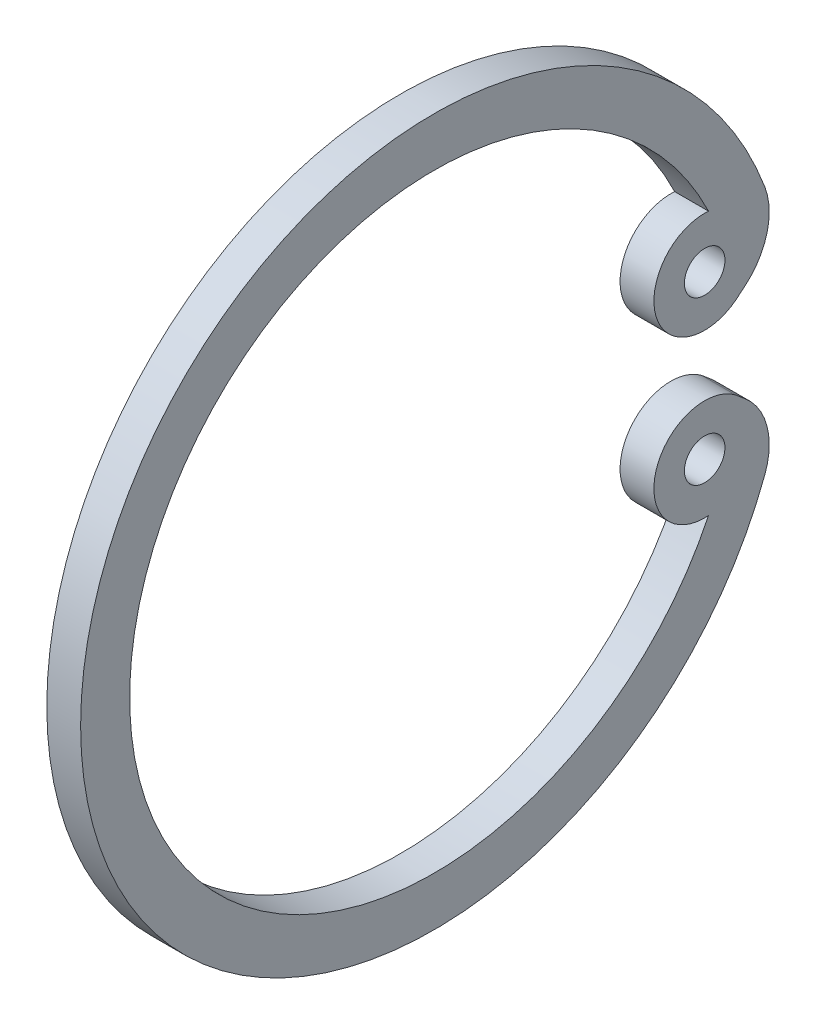
ISO-10303-21;
HEADER;
FILE_DESCRIPTION(('STEP AP214'),'2;1');
FILE_NAME('part.step','',(''),(''),'','','');
FILE_SCHEMA(('AUTOMOTIVE_DESIGN { 1 0 10303 214 1 1 1 1 }'));
ENDSEC;
DATA;
#1=APPLICATION_CONTEXT('core data for automotive mechanical design processes');
#2=APPLICATION_PROTOCOL_DEFINITION('international standard','automotive_design',2000,#1);
#3=PRODUCT_CONTEXT('',#1,'mechanical');
#4=PRODUCT('Part','Part','',(#3));
#5=PRODUCT_RELATED_PRODUCT_CATEGORY('part','',(#4));
#6=PRODUCT_DEFINITION_FORMATION('','',#4);
#7=PRODUCT_DEFINITION_CONTEXT('part definition',#1,'design');
#8=PRODUCT_DEFINITION('design','',#6,#7);
#9=PRODUCT_DEFINITION_SHAPE('','',#8);
#10=(LENGTH_UNIT() NAMED_UNIT(*) SI_UNIT(.MILLI.,.METRE.));
#11=(NAMED_UNIT(*) PLANE_ANGLE_UNIT() SI_UNIT($,.RADIAN.));
#12=(NAMED_UNIT(*) SI_UNIT($,.STERADIAN.) SOLID_ANGLE_UNIT());
#13=UNCERTAINTY_MEASURE_WITH_UNIT(LENGTH_MEASURE(1.E-05),#10,'distance_accuracy_value','');
#14=(GEOMETRIC_REPRESENTATION_CONTEXT(3) GLOBAL_UNCERTAINTY_ASSIGNED_CONTEXT((#13)) GLOBAL_UNIT_ASSIGNED_CONTEXT((#10,
#11,#12)) REPRESENTATION_CONTEXT('',''));
#15=CARTESIAN_POINT('',(0.,0.,0.));
#16=DIRECTION('',(0.,0.,1.));
#17=DIRECTION('',(1.,0.,0.));
#18=AXIS2_PLACEMENT_3D('',#15,#16,#17);
#19=CARTESIAN_POINT('',(18.3611111111111,-0.00016281321046866,9.93971753018335));
#20=DIRECTION('',(1.,0.,0.));
#21=DIRECTION('',(0.,0.,-1.));
#22=AXIS2_PLACEMENT_3D('',#19,#20,#21);
#23=CYLINDRICAL_SURFACE('',#22,2.5000000372529);
#24=CARTESIAN_POINT('',(18.6388888888889,-0.00016281321046866,9.93971753018335));
#25=DIRECTION('',(-1.,0.,0.));
#26=DIRECTION('',(0.,0.,1.));
#27=AXIS2_PLACEMENT_3D('',#24,#25,#26);
#28=CIRCLE('',#27,2.5000000372529);
#29=CARTESIAN_POINT('',(18.6388888888889,-1.08255334468496,7.68618010567962));
#30=VERTEX_POINT('',#29);
#31=CARTESIAN_POINT('',(18.6388888888889,1.08222771826402,7.68618010567963));
#32=VERTEX_POINT('',#31);
#33=EDGE_CURVE('E133',#30,#32,#28,.T.);
#34=ORIENTED_EDGE('',*,*,#33,.F.);
#35=DIRECTION('',(1.,0.,0.));
#36=VECTOR('',#35,1.);
#37=CARTESIAN_POINT('',(18.3611111111111,-1.08255334468496,7.68618010567962));
#38=LINE('',#37,#36);
#39=CARTESIAN_POINT('',(18.3611111111111,-1.08255334468496,7.68618010567962));
#40=VERTEX_POINT('',#39);
#41=EDGE_CURVE('E11',#40,#30,#38,.T.);
#42=ORIENTED_EDGE('',*,*,#41,.F.);
#43=CARTESIAN_POINT('',(18.3611111111111,-0.00016281321046866,9.93971753018335));
#44=DIRECTION('',(-1.,0.,0.));
#45=DIRECTION('',(0.,0.,1.));
#46=AXIS2_PLACEMENT_3D('',#43,#44,#45);
#47=CIRCLE('',#46,2.5000000372529);
#48=CARTESIAN_POINT('',(18.3611111111111,1.08222771826402,7.68618010567963));
#49=VERTEX_POINT('',#48);
#50=EDGE_CURVE('E154',#40,#49,#47,.T.);
#51=ORIENTED_EDGE('',*,*,#50,.T.);
#52=DIRECTION('',(1.,0.,0.));
#53=VECTOR('',#52,1.);
#54=CARTESIAN_POINT('',(18.3611111111111,1.08222771826402,7.68618010567963));
#55=LINE('',#54,#53);
#56=EDGE_CURVE('E39',#49,#32,#55,.T.);
#57=ORIENTED_EDGE('',*,*,#56,.T.);
#58=EDGE_LOOP('',(#34,#42,#51,#57));
#59=FACE_BOUND('',#58,.T.);
#60=ADVANCED_FACE('F36',(#59),#23,.F.);
#61=CARTESIAN_POINT('',(18.3611111111111,-0.666917459563021,7.71771885059295));
#62=DIRECTION('',(1.,0.,0.));
#63=DIRECTION('',(0.,0.,-1.));
#64=AXIS2_PLACEMENT_3D('',#61,#62,#63);
#65=CYLINDRICAL_SURFACE('',#64,0.416830758740048);
#66=CARTESIAN_POINT('',(18.6388888888889,-0.666917459563021,7.71771885059295));
#67=DIRECTION('',(1.,0.,0.));
#68=DIRECTION('',(0.,0.,-1.));
#69=AXIS2_PLACEMENT_3D('',#66,#67,#68);
#70=CIRCLE('',#69,0.416830758740048);
#71=CARTESIAN_POINT('',(18.6388888888889,-0.337229909778591,7.46266199232613));
#72=VERTEX_POINT('',#71);
#73=EDGE_CURVE('E152',#72,#30,#70,.T.);
#74=ORIENTED_EDGE('',*,*,#73,.F.);
#75=DIRECTION('',(1.,0.,0.));
#76=VECTOR('',#75,1.);
#77=CARTESIAN_POINT('',(18.3611111111111,-0.337229909778591,7.46266199232613));
#78=LINE('',#77,#76);
#79=CARTESIAN_POINT('',(18.3611111111111,-0.337229909778591,7.46266199232613));
#80=VERTEX_POINT('',#79);
#81=EDGE_CURVE('E45',#80,#72,#78,.T.);
#82=ORIENTED_EDGE('',*,*,#81,.F.);
#83=CARTESIAN_POINT('',(18.3611111111111,-0.666917459563021,7.71771885059295));
#84=DIRECTION('',(1.,0.,0.));
#85=DIRECTION('',(0.,0.,-1.));
#86=AXIS2_PLACEMENT_3D('',#83,#84,#85);
#87=CIRCLE('',#86,0.416830758740048);
#88=EDGE_CURVE('E123',#80,#40,#87,.T.);
#89=ORIENTED_EDGE('',*,*,#88,.T.);
#90=ORIENTED_EDGE('',*,*,#41,.T.);
#91=EDGE_LOOP('',(#74,#82,#89,#90));
#92=FACE_BOUND('',#91,.T.);
#93=ADVANCED_FACE('F166',(#92),#65,.T.);
#94=CARTESIAN_POINT('',(18.3611111111111,-0.401543008719923,7.38601662561193));
#95=DIRECTION('',(0.,0.766044443118982,-0.642787609686534));
#96=DIRECTION('',(0.,0.642787609686534,0.766044443118982));
#97=AXIS2_PLACEMENT_3D('',#94,#95,#96);
#98=PLANE('',#97);
#99=DIRECTION('',(0.,0.642787609686534,0.766044443118982));
#100=VECTOR('',#99,1.);
#101=CARTESIAN_POINT('',(18.6388888888889,-0.401543008719923,7.38601662561193));
#102=LINE('',#101,#100);
#103=CARTESIAN_POINT('',(18.6388888888889,-0.401543008719923,7.38601662561193));
#104=VERTEX_POINT('',#103);
#105=EDGE_CURVE('E110',#104,#72,#102,.T.);
#106=ORIENTED_EDGE('',*,*,#105,.F.);
#107=DIRECTION('',(1.,0.,0.));
#108=VECTOR('',#107,1.);
#109=CARTESIAN_POINT('',(18.3611111111111,-0.401543008719923,7.38601662561193));
#110=LINE('',#109,#108);
#111=CARTESIAN_POINT('',(18.3611111111111,-0.401543008719923,7.38601662561193));
#112=VERTEX_POINT('',#111);
#113=EDGE_CURVE('E105',#112,#104,#110,.T.);
#114=ORIENTED_EDGE('',*,*,#113,.F.);
#115=DIRECTION('',(0.,0.642787609686534,0.766044443118982));
#116=VECTOR('',#115,1.);
#117=CARTESIAN_POINT('',(18.3611111111111,-0.401543008719923,7.38601662561193));
#118=LINE('',#117,#116);
#119=EDGE_CURVE('E108',#112,#80,#118,.T.);
#120=ORIENTED_EDGE('',*,*,#119,.T.);
#121=ORIENTED_EDGE('',*,*,#81,.T.);
#122=EDGE_LOOP('',(#106,#114,#120,#121));
#123=FACE_BOUND('',#122,.T.);
#124=ADVANCED_FACE('F107',(#123),#98,.T.);
#125=CARTESIAN_POINT('',(18.3611111111111,-0.827123254897134,7.74312085321556));
#126=DIRECTION('',(1.,0.,0.));
#127=DIRECTION('',(0.,0.,-1.));
#128=AXIS2_PLACEMENT_3D('',#125,#126,#127);
#129=CYLINDRICAL_SURFACE('',#128,0.555555555555558);
#130=CARTESIAN_POINT('',(18.6388888888889,-0.827123254897134,7.74312085321556));
#131=DIRECTION('',(1.,0.,0.));
#132=DIRECTION('',(0.,0.,-1.));
#133=AXIS2_PLACEMENT_3D('',#130,#131,#132);
#134=CIRCLE('',#133,0.555555555555558);
#135=CARTESIAN_POINT('',(18.6388888888889,-1.02286333631576,7.22319028493276));
#136=VERTEX_POINT('',#135);
#137=EDGE_CURVE('E149',#136,#104,#134,.T.);
#138=ORIENTED_EDGE('',*,*,#137,.F.);
#139=DIRECTION('',(1.,0.,0.));
#140=VECTOR('',#139,1.);
#141=CARTESIAN_POINT('',(18.3611111111111,-1.02286333631576,7.22319028493276));
#142=LINE('',#141,#140);
#143=CARTESIAN_POINT('',(18.3611111111111,-1.02286333631576,7.22319028493276));
#144=VERTEX_POINT('',#143);
#145=EDGE_CURVE('E115',#144,#136,#142,.T.);
#146=ORIENTED_EDGE('',*,*,#145,.F.);
#147=CARTESIAN_POINT('',(18.3611111111111,-0.827123254897134,7.74312085321556));
#148=DIRECTION('',(1.,0.,0.));
#149=DIRECTION('',(0.,0.,-1.));
#150=AXIS2_PLACEMENT_3D('',#147,#148,#149);
#151=CIRCLE('',#150,0.555555555555558);
#152=EDGE_CURVE('E121',#144,#112,#151,.T.);
#153=ORIENTED_EDGE('',*,*,#152,.T.);
#154=ORIENTED_EDGE('',*,*,#113,.T.);
#155=EDGE_LOOP('',(#138,#146,#153,#154));
#156=FACE_BOUND('',#155,.T.);
#157=ADVANCED_FACE('F125',(#156),#129,.T.);
#158=CARTESIAN_POINT('',(18.3611111111111,-0.00016281321046866,9.93971753018335));
#159=DIRECTION('',(1.,0.,0.));
#160=DIRECTION('',(0.,0.,-1.));
#161=AXIS2_PLACEMENT_3D('',#158,#159,#160);
#162=CYLINDRICAL_SURFACE('',#161,2.90266026846901);
#163=CARTESIAN_POINT('',(18.6388888888889,-0.00016281321046866,9.93971753018335));
#164=DIRECTION('',(1.,0.,0.));
#165=DIRECTION('',(0.,0.,-1.));
#166=AXIS2_PLACEMENT_3D('',#163,#164,#165);
#167=CIRCLE('',#166,2.90266026846901);
#168=CARTESIAN_POINT('',(18.6388888888889,1.0225283518045,7.22318676187813));
#169=VERTEX_POINT('',#168);
#170=EDGE_CURVE('E146',#169,#136,#167,.T.);
#171=ORIENTED_EDGE('',*,*,#170,.F.);
#172=DIRECTION('',(1.,0.,0.));
#173=VECTOR('',#172,1.);
#174=CARTESIAN_POINT('',(18.3611111111111,1.0225283518045,7.22318676187813));
#175=LINE('',#174,#173);
#176=CARTESIAN_POINT('',(18.3611111111111,1.0225283518045,7.22318676187813));
#177=VERTEX_POINT('',#176);
#178=EDGE_CURVE('E158',#177,#169,#175,.T.);
#179=ORIENTED_EDGE('',*,*,#178,.F.);
#180=CARTESIAN_POINT('',(18.3611111111111,-0.00016281321046866,9.93971753018335));
#181=DIRECTION('',(1.,0.,0.));
#182=DIRECTION('',(0.,0.,-1.));
#183=AXIS2_PLACEMENT_3D('',#180,#181,#182);
#184=CIRCLE('',#183,2.90266026846901);
#185=EDGE_CURVE('E126',#177,#144,#184,.T.);
#186=ORIENTED_EDGE('',*,*,#185,.T.);
#187=ORIENTED_EDGE('',*,*,#145,.T.);
#188=EDGE_LOOP('',(#171,#179,#186,#187));
#189=FACE_BOUND('',#188,.T.);
#190=ADVANCED_FACE('F179',(#189),#162,.T.);
#191=CARTESIAN_POINT('',(18.3611111111111,0.826790061480457,7.74311800445706));
#192=DIRECTION('',(1.,0.,0.));
#193=DIRECTION('',(0.,0.,-1.));
#194=AXIS2_PLACEMENT_3D('',#191,#192,#193);
#195=CYLINDRICAL_SURFACE('',#194,0.555555555555555);
#196=CARTESIAN_POINT('',(18.6388888888889,0.826790061480457,7.74311800445706));
#197=DIRECTION('',(1.,0.,0.));
#198=DIRECTION('',(0.,0.,-1.));
#199=AXIS2_PLACEMENT_3D('',#196,#197,#198);
#200=CIRCLE('',#199,0.555555555555555);
#201=CARTESIAN_POINT('',(18.6388888888889,0.401209815303247,7.38601377685343));
#202=VERTEX_POINT('',#201);
#203=EDGE_CURVE('E143',#202,#169,#200,.T.);
#204=ORIENTED_EDGE('',*,*,#203,.F.);
#205=DIRECTION('',(1.,0.,0.));
#206=VECTOR('',#205,1.);
#207=CARTESIAN_POINT('',(18.3611111111111,0.401209815303247,7.38601377685343));
#208=LINE('',#207,#206);
#209=CARTESIAN_POINT('',(18.3611111111111,0.401209815303247,7.38601377685343));
#210=VERTEX_POINT('',#209);
#211=EDGE_CURVE('E160',#210,#202,#208,.T.);
#212=ORIENTED_EDGE('',*,*,#211,.F.);
#213=CARTESIAN_POINT('',(18.3611111111111,0.826790061480457,7.74311800445706));
#214=DIRECTION('',(1.,0.,0.));
#215=DIRECTION('',(0.,0.,-1.));
#216=AXIS2_PLACEMENT_3D('',#213,#214,#215);
#217=CIRCLE('',#216,0.555555555555555);
#218=EDGE_CURVE('E128',#210,#177,#217,.T.);
#219=ORIENTED_EDGE('',*,*,#218,.T.);
#220=ORIENTED_EDGE('',*,*,#178,.T.);
#221=EDGE_LOOP('',(#204,#212,#219,#220));
#222=FACE_BOUND('',#221,.T.);
#223=ADVANCED_FACE('F182',(#222),#195,.T.);
#224=CARTESIAN_POINT('',(18.3611111111111,0.337156289867929,7.46285995798236));
#225=DIRECTION('',(0.,-0.768147331821205,-0.640273126576435));
#226=DIRECTION('',(0.,0.640273126576435,-0.768147331821205));
#227=AXIS2_PLACEMENT_3D('',#224,#225,#226);
#228=PLANE('',#227);
#229=DIRECTION('',(0.,0.640273126576435,-0.768147331821205));
#230=VECTOR('',#229,1.);
#231=CARTESIAN_POINT('',(18.6388888888889,0.337156289867929,7.46285995798236));
#232=LINE('',#231,#230);
#233=CARTESIAN_POINT('',(18.6388888888889,0.337156289867929,7.46285995798236));
#234=VERTEX_POINT('',#233);
#235=EDGE_CURVE('E140',#234,#202,#232,.T.);
#236=ORIENTED_EDGE('',*,*,#235,.F.);
#237=DIRECTION('',(1.,0.,0.));
#238=VECTOR('',#237,1.);
#239=CARTESIAN_POINT('',(18.3611111111111,0.337156289867929,7.46285995798236));
#240=LINE('',#239,#238);
#241=CARTESIAN_POINT('',(18.3611111111111,0.337156289867929,7.46285995798236));
#242=VERTEX_POINT('',#241);
#243=EDGE_CURVE('E161',#242,#234,#240,.T.);
#244=ORIENTED_EDGE('',*,*,#243,.F.);
#245=DIRECTION('',(0.,0.640273126576435,-0.768147331821205));
#246=VECTOR('',#245,1.);
#247=CARTESIAN_POINT('',(18.3611111111111,0.337156289867929,7.46285995798236));
#248=LINE('',#247,#246);
#249=EDGE_CURVE('E228',#242,#210,#248,.T.);
#250=ORIENTED_EDGE('',*,*,#249,.T.);
#251=ORIENTED_EDGE('',*,*,#211,.T.);
#252=EDGE_LOOP('',(#236,#244,#250,#251));
#253=FACE_BOUND('',#252,.T.);
#254=ADVANCED_FACE('F186',(#253),#228,.T.);
#255=CARTESIAN_POINT('',(18.3611111111111,0.666759358402729,7.71775783620726));
#256=DIRECTION('',(1.,0.,0.));
#257=DIRECTION('',(0.,0.,-1.));
#258=AXIS2_PLACEMENT_3D('',#255,#256,#257);
#259=CYLINDRICAL_SURFACE('',#258,0.416666666666666);
#260=CARTESIAN_POINT('',(18.6388888888889,0.666759358402729,7.71775783620726));
#261=DIRECTION('',(1.,0.,0.));
#262=DIRECTION('',(0.,0.,-1.));
#263=AXIS2_PLACEMENT_3D('',#260,#261,#262);
#264=CIRCLE('',#263,0.416666666666666);
#265=EDGE_CURVE('E136',#32,#234,#264,.T.);
#266=ORIENTED_EDGE('',*,*,#265,.F.);
#267=ORIENTED_EDGE('',*,*,#56,.F.);
#268=CARTESIAN_POINT('',(18.3611111111111,0.666759358402729,7.71775783620726));
#269=DIRECTION('',(1.,0.,0.));
#270=DIRECTION('',(0.,0.,-1.));
#271=AXIS2_PLACEMENT_3D('',#268,#269,#270);
#272=CIRCLE('',#271,0.416666666666666);
#273=EDGE_CURVE('E226',#49,#242,#272,.T.);
#274=ORIENTED_EDGE('',*,*,#273,.T.);
#275=ORIENTED_EDGE('',*,*,#243,.T.);
#276=EDGE_LOOP('',(#266,#267,#274,#275));
#277=FACE_BOUND('',#276,.T.);
#278=ADVANCED_FACE('F163',(#277),#259,.T.);
#279=CARTESIAN_POINT('',(18.3611111111111,-0.00016281321046866,9.93971753018335));
#280=DIRECTION('',(-1.,0.,0.));
#281=DIRECTION('',(0.,0.,1.));
#282=AXIS2_PLACEMENT_3D('',#279,#280,#281);
#283=PLANE('',#282);
#284=CARTESIAN_POINT('',(18.3611111111111,0.66653768838861,7.71760813916771));
#285=DIRECTION('',(1.,0.,0.));
#286=DIRECTION('',(0.,0.,1.));
#287=AXIS2_PLACEMENT_3D('',#284,#285,#286);
#288=CIRCLE('',#287,0.166666666666667);
#289=CARTESIAN_POINT('',(18.3611111111111,0.66653768838861,7.88427480583437));
#290=VERTEX_POINT('',#289);
#291=EDGE_CURVE('E213',#290,#290,#288,.T.);
#292=ORIENTED_EDGE('',*,*,#291,.T.);
#293=EDGE_LOOP('',(#292));
#294=FACE_BOUND('',#293,.T.);
#295=CARTESIAN_POINT('',(18.3611111111111,-0.666795644944723,7.71760813916771));
#296=DIRECTION('',(1.,0.,0.));
#297=DIRECTION('',(0.,0.,1.));
#298=AXIS2_PLACEMENT_3D('',#295,#296,#297);
#299=CIRCLE('',#298,0.166666666666667);
#300=CARTESIAN_POINT('',(18.3611111111111,-0.666795644944723,7.88427480583437));
#301=VERTEX_POINT('',#300);
#302=EDGE_CURVE('E137',#301,#301,#299,.T.);
#303=ORIENTED_EDGE('',*,*,#302,.T.);
#304=EDGE_LOOP('',(#303));
#305=FACE_BOUND('',#304,.T.);
#306=ORIENTED_EDGE('',*,*,#50,.F.);
#307=ORIENTED_EDGE('',*,*,#88,.F.);
#308=ORIENTED_EDGE('',*,*,#119,.F.);
#309=ORIENTED_EDGE('',*,*,#152,.F.);
#310=ORIENTED_EDGE('',*,*,#185,.F.);
#311=ORIENTED_EDGE('',*,*,#218,.F.);
#312=ORIENTED_EDGE('',*,*,#249,.F.);
#313=ORIENTED_EDGE('',*,*,#273,.F.);
#314=EDGE_LOOP('',(#306,#307,#308,#309,#310,#311,#312,#313));
#315=FACE_BOUND('',#314,.T.);
#316=ADVANCED_FACE('F119',(#294,#305,#315),#283,.T.);
#317=CARTESIAN_POINT('',(18.6388888888889,-0.00016281321046866,9.93971753018335));
#318=DIRECTION('',(-1.,0.,0.));
#319=DIRECTION('',(0.,0.,1.));
#320=AXIS2_PLACEMENT_3D('',#317,#318,#319);
#321=PLANE('',#320);
#322=CARTESIAN_POINT('',(18.6388888888889,0.66653768838861,7.71760813916771));
#323=DIRECTION('',(1.,0.,0.));
#324=DIRECTION('',(0.,0.,1.));
#325=AXIS2_PLACEMENT_3D('',#322,#323,#324);
#326=CIRCLE('',#325,0.166666666666667);
#327=CARTESIAN_POINT('',(18.6388888888889,0.66653768838861,7.88427480583437));
#328=VERTEX_POINT('',#327);
#329=EDGE_CURVE('E216',#328,#328,#326,.T.);
#330=ORIENTED_EDGE('',*,*,#329,.F.);
#331=EDGE_LOOP('',(#330));
#332=FACE_BOUND('',#331,.T.);
#333=CARTESIAN_POINT('',(18.6388888888889,-0.666795644944723,7.71760813916771));
#334=DIRECTION('',(1.,0.,0.));
#335=DIRECTION('',(0.,0.,1.));
#336=AXIS2_PLACEMENT_3D('',#333,#334,#335);
#337=CIRCLE('',#336,0.166666666666667);
#338=CARTESIAN_POINT('',(18.6388888888889,-0.666795644944723,7.88427480583437));
#339=VERTEX_POINT('',#338);
#340=EDGE_CURVE('E218',#339,#339,#337,.T.);
#341=ORIENTED_EDGE('',*,*,#340,.F.);
#342=EDGE_LOOP('',(#341));
#343=FACE_BOUND('',#342,.T.);
#344=ORIENTED_EDGE('',*,*,#33,.T.);
#345=ORIENTED_EDGE('',*,*,#265,.T.);
#346=ORIENTED_EDGE('',*,*,#235,.T.);
#347=ORIENTED_EDGE('',*,*,#203,.T.);
#348=ORIENTED_EDGE('',*,*,#170,.T.);
#349=ORIENTED_EDGE('',*,*,#137,.T.);
#350=ORIENTED_EDGE('',*,*,#105,.T.);
#351=ORIENTED_EDGE('',*,*,#73,.T.);
#352=EDGE_LOOP('',(#344,#345,#346,#347,#348,#349,#350,#351));
#353=FACE_BOUND('',#352,.T.);
#354=ADVANCED_FACE('F165',(#332,#343,#353),#321,.F.);
#355=CARTESIAN_POINT('',(18.3611111111111,-0.666795644944723,7.71760813916771));
#356=DIRECTION('',(1.,0.,0.));
#357=DIRECTION('',(0.,0.,-1.));
#358=AXIS2_PLACEMENT_3D('',#355,#356,#357);
#359=CYLINDRICAL_SURFACE('',#358,0.166666666666667);
#360=ORIENTED_EDGE('',*,*,#302,.F.);
#361=EDGE_LOOP('',(#360));
#362=FACE_BOUND('',#361,.T.);
#363=ORIENTED_EDGE('',*,*,#340,.T.);
#364=EDGE_LOOP('',(#363));
#365=FACE_BOUND('',#364,.T.);
#366=ADVANCED_FACE('F198',(#362,#365),#359,.F.);
#367=CARTESIAN_POINT('',(18.3611111111111,0.66653768838861,7.71760813916771));
#368=DIRECTION('',(1.,0.,0.));
#369=DIRECTION('',(0.,0.,-1.));
#370=AXIS2_PLACEMENT_3D('',#367,#368,#369);
#371=CYLINDRICAL_SURFACE('',#370,0.166666666666667);
#372=ORIENTED_EDGE('',*,*,#291,.F.);
#373=EDGE_LOOP('',(#372));
#374=FACE_BOUND('',#373,.T.);
#375=ORIENTED_EDGE('',*,*,#329,.T.);
#376=EDGE_LOOP('',(#375));
#377=FACE_BOUND('',#376,.T.);
#378=ADVANCED_FACE('F205',(#374,#377),#371,.F.);
#379=CLOSED_SHELL('',(#60,#93,#124,#157,#190,#223,#254,#278,#316,#354,#366,#378));
#380=MANIFOLD_SOLID_BREP('B2',#379);
#381=ADVANCED_BREP_SHAPE_REPRESENTATION('',(#18,#380),#14);
#382=SHAPE_DEFINITION_REPRESENTATION(#9,#381);
ENDSEC;
END-ISO-10303-21;
